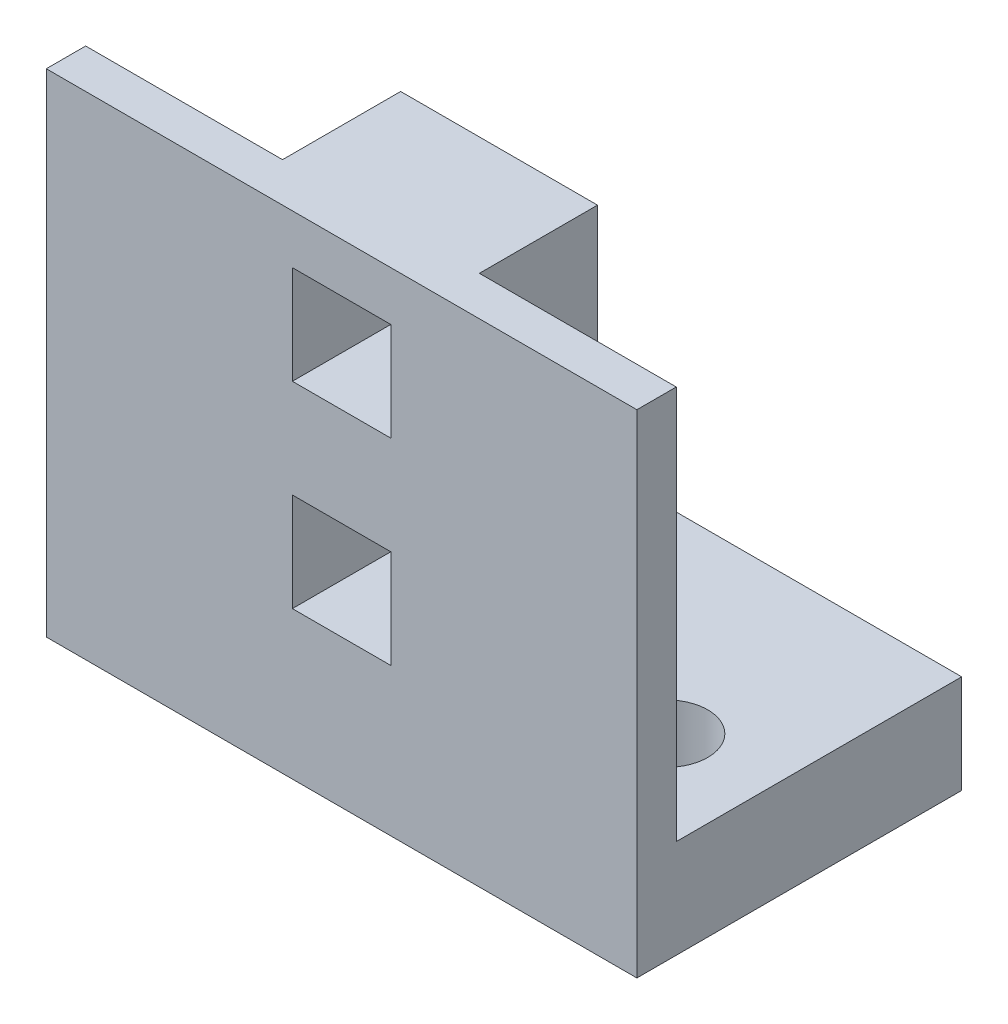
ISO-10303-21;
HEADER;
FILE_DESCRIPTION(('STEP AP214'),'2;1');
FILE_NAME('part.step','',(''),(''),'','','');
FILE_SCHEMA(('AUTOMOTIVE_DESIGN { 1 0 10303 214 1 1 1 1 }'));
ENDSEC;
DATA;
#1=APPLICATION_CONTEXT('core data for automotive mechanical design processes');
#2=APPLICATION_PROTOCOL_DEFINITION('international standard','automotive_design',2000,#1);
#3=PRODUCT_CONTEXT('',#1,'mechanical');
#4=PRODUCT('Part','Part','',(#3));
#5=PRODUCT_RELATED_PRODUCT_CATEGORY('part','',(#4));
#6=PRODUCT_DEFINITION_FORMATION('','',#4);
#7=PRODUCT_DEFINITION_CONTEXT('part definition',#1,'design');
#8=PRODUCT_DEFINITION('design','',#6,#7);
#9=PRODUCT_DEFINITION_SHAPE('','',#8);
#10=(LENGTH_UNIT() NAMED_UNIT(*) SI_UNIT(.MILLI.,.METRE.));
#11=(NAMED_UNIT(*) PLANE_ANGLE_UNIT() SI_UNIT($,.RADIAN.));
#12=(NAMED_UNIT(*) SI_UNIT($,.STERADIAN.) SOLID_ANGLE_UNIT());
#13=UNCERTAINTY_MEASURE_WITH_UNIT(LENGTH_MEASURE(1.E-05),#10,'distance_accuracy_value','');
#14=(GEOMETRIC_REPRESENTATION_CONTEXT(3) GLOBAL_UNCERTAINTY_ASSIGNED_CONTEXT((#13)) GLOBAL_UNIT_ASSIGNED_CONTEXT((#10,
#11,#12)) REPRESENTATION_CONTEXT('',''));
#15=CARTESIAN_POINT('',(0.,0.,0.));
#16=DIRECTION('',(0.,0.,1.));
#17=DIRECTION('',(1.,0.,0.));
#18=AXIS2_PLACEMENT_3D('',#15,#16,#17);
#19=CARTESIAN_POINT('',(0.,5.,0.));
#20=DIRECTION('',(0.,1.,0.));
#21=DIRECTION('',(0.,0.,1.));
#22=AXIS2_PLACEMENT_3D('',#19,#20,#21);
#23=PLANE('',#22);
#24=CARTESIAN_POINT('',(-10.,5.,1.75));
#25=DIRECTION('',(0.,1.,0.));
#26=DIRECTION('',(0.,0.,1.));
#27=AXIS2_PLACEMENT_3D('',#24,#25,#26);
#28=CIRCLE('',#27,2.1);
#29=CARTESIAN_POINT('',(-10.,5.,3.85));
#30=VERTEX_POINT('',#29);
#31=EDGE_CURVE('E337',#30,#30,#28,.T.);
#32=ORIENTED_EDGE('',*,*,#31,.F.);
#33=EDGE_LOOP('',(#32));
#34=FACE_BOUND('',#33,.T.);
#35=CARTESIAN_POINT('',(10.,5.,1.75));
#36=DIRECTION('',(0.,1.,0.));
#37=DIRECTION('',(0.,0.,1.));
#38=AXIS2_PLACEMENT_3D('',#35,#36,#37);
#39=CIRCLE('',#38,2.1);
#40=CARTESIAN_POINT('',(10.,5.,3.85));
#41=VERTEX_POINT('',#40);
#42=EDGE_CURVE('E329',#41,#41,#39,.T.);
#43=ORIENTED_EDGE('',*,*,#42,.F.);
#44=EDGE_LOOP('',(#43));
#45=FACE_BOUND('',#44,.T.);
#46=DIRECTION('',(-1.,0.,0.));
#47=VECTOR('',#46,1.);
#48=CARTESIAN_POINT('',(5.,5.,0.249999999999999));
#49=LINE('',#48,#47);
#50=CARTESIAN_POINT('',(5.,5.,0.249999999999999));
#51=VERTEX_POINT('',#50);
#52=CARTESIAN_POINT('',(-5.00000000000001,5.,0.249999999999999));
#53=VERTEX_POINT('',#52);
#54=EDGE_CURVE('E183',#51,#53,#49,.T.);
#55=ORIENTED_EDGE('',*,*,#54,.F.);
#56=DIRECTION('',(0.,0.,1.));
#57=VECTOR('',#56,1.);
#58=CARTESIAN_POINT('',(5.,5.,2.25));
#59=LINE('',#58,#57);
#60=CARTESIAN_POINT('',(5.,5.,6.25));
#61=VERTEX_POINT('',#60);
#62=EDGE_CURVE('E63',#51,#61,#59,.T.);
#63=ORIENTED_EDGE('',*,*,#62,.T.);
#64=DIRECTION('',(1.,0.,0.));
#65=VECTOR('',#64,1.);
#66=CARTESIAN_POINT('',(-15.,5.,6.25));
#67=LINE('',#66,#65);
#68=CARTESIAN_POINT('',(15.,5.,6.25));
#69=VERTEX_POINT('',#68);
#70=EDGE_CURVE('E305',#61,#69,#67,.T.);
#71=ORIENTED_EDGE('',*,*,#70,.T.);
#72=DIRECTION('',(0.,0.,-1.));
#73=VECTOR('',#72,1.);
#74=CARTESIAN_POINT('',(15.,5.,-8.25));
#75=LINE('',#74,#73);
#76=CARTESIAN_POINT('',(15.,5.,-8.25));
#77=VERTEX_POINT('',#76);
#78=EDGE_CURVE('E345',#69,#77,#75,.T.);
#79=ORIENTED_EDGE('',*,*,#78,.T.);
#80=DIRECTION('',(-1.,0.,0.));
#81=VECTOR('',#80,1.);
#82=CARTESIAN_POINT('',(-15.,5.,-8.25));
#83=LINE('',#82,#81);
#84=CARTESIAN_POINT('',(-15.,5.,-8.25));
#85=VERTEX_POINT('',#84);
#86=EDGE_CURVE('E348',#77,#85,#83,.T.);
#87=ORIENTED_EDGE('',*,*,#86,.T.);
#88=DIRECTION('',(0.,0.,1.));
#89=VECTOR('',#88,1.);
#90=CARTESIAN_POINT('',(-15.,5.,-8.25));
#91=LINE('',#90,#89);
#92=CARTESIAN_POINT('',(-15.,5.,6.25));
#93=VERTEX_POINT('',#92);
#94=EDGE_CURVE('E352',#85,#93,#91,.T.);
#95=ORIENTED_EDGE('',*,*,#94,.T.);
#96=CARTESIAN_POINT('',(-5.00000000000001,5.,6.25));
#97=VERTEX_POINT('',#96);
#98=EDGE_CURVE('E306',#93,#97,#67,.T.);
#99=ORIENTED_EDGE('',*,*,#98,.T.);
#100=DIRECTION('',(0.,0.,1.));
#101=VECTOR('',#100,1.);
#102=CARTESIAN_POINT('',(-5.00000000000001,5.,2.25));
#103=LINE('',#102,#101);
#104=EDGE_CURVE('E55',#53,#97,#103,.T.);
#105=ORIENTED_EDGE('',*,*,#104,.F.);
#106=EDGE_LOOP('',(#55,#63,#71,#79,#87,#95,#99,#105));
#107=FACE_BOUND('',#106,.T.);
#108=ADVANCED_FACE('F39',(#34,#45,#107),#23,.T.);
#109=CARTESIAN_POINT('',(0.,0.,6.25));
#110=DIRECTION('',(0.,0.,-1.));
#111=DIRECTION('',(-1.,0.,0.));
#112=AXIS2_PLACEMENT_3D('',#109,#110,#111);
#113=PLANE('',#112);
#114=ORIENTED_EDGE('',*,*,#70,.F.);
#115=DIRECTION('',(0.,-1.,0.));
#116=VECTOR('',#115,1.);
#117=CARTESIAN_POINT('',(5.,25.,6.25));
#118=LINE('',#117,#116);
#119=CARTESIAN_POINT('',(5.,25.,6.25));
#120=VERTEX_POINT('',#119);
#121=EDGE_CURVE('E225',#120,#61,#118,.T.);
#122=ORIENTED_EDGE('',*,*,#121,.F.);
#123=DIRECTION('',(-1.,0.,0.));
#124=VECTOR('',#123,1.);
#125=CARTESIAN_POINT('',(-15.,25.,6.25));
#126=LINE('',#125,#124);
#127=CARTESIAN_POINT('',(15.,25.,6.25));
#128=VERTEX_POINT('',#127);
#129=EDGE_CURVE('E314',#128,#120,#126,.T.);
#130=ORIENTED_EDGE('',*,*,#129,.F.);
#131=DIRECTION('',(0.,1.,0.));
#132=VECTOR('',#131,1.);
#133=CARTESIAN_POINT('',(15.,5.,6.25));
#134=LINE('',#133,#132);
#135=EDGE_CURVE('E309',#69,#128,#134,.T.);
#136=ORIENTED_EDGE('',*,*,#135,.F.);
#137=EDGE_LOOP('',(#114,#122,#130,#136));
#138=FACE_BOUND('',#137,.T.);
#139=ADVANCED_FACE('F407',(#138),#113,.T.);
#140=CARTESIAN_POINT('',(-5.00000000000001,25.,6.25));
#141=VERTEX_POINT('',#140);
#142=CARTESIAN_POINT('',(-15.,25.,6.25));
#143=VERTEX_POINT('',#142);
#144=EDGE_CURVE('E313',#141,#143,#126,.T.);
#145=ORIENTED_EDGE('',*,*,#144,.F.);
#146=DIRECTION('',(0.,1.,0.));
#147=VECTOR('',#146,1.);
#148=CARTESIAN_POINT('',(-5.,25.,6.25));
#149=LINE('',#148,#147);
#150=EDGE_CURVE('E171',#97,#141,#149,.T.);
#151=ORIENTED_EDGE('',*,*,#150,.F.);
#152=ORIENTED_EDGE('',*,*,#98,.F.);
#153=DIRECTION('',(0.,-1.,0.));
#154=VECTOR('',#153,1.);
#155=CARTESIAN_POINT('',(-15.,5.,6.25));
#156=LINE('',#155,#154);
#157=EDGE_CURVE('E301',#143,#93,#156,.T.);
#158=ORIENTED_EDGE('',*,*,#157,.F.);
#159=EDGE_LOOP('',(#145,#151,#152,#158));
#160=FACE_BOUND('',#159,.T.);
#161=ADVANCED_FACE('F398',(#160),#113,.T.);
#162=CARTESIAN_POINT('',(0.,0.,0.));
#163=DIRECTION('',(0.,1.,0.));
#164=DIRECTION('',(0.,0.,1.));
#165=AXIS2_PLACEMENT_3D('',#162,#163,#164);
#166=PLANE('',#165);
#167=DIRECTION('',(0.,0.,-1.));
#168=VECTOR('',#167,1.);
#169=CARTESIAN_POINT('',(15.,0.,-8.25));
#170=LINE('',#169,#168);
#171=CARTESIAN_POINT('',(15.,0.,8.25));
#172=VERTEX_POINT('',#171);
#173=CARTESIAN_POINT('',(15.,0.,-8.25));
#174=VERTEX_POINT('',#173);
#175=EDGE_CURVE('E341',#172,#174,#170,.T.);
#176=ORIENTED_EDGE('',*,*,#175,.F.);
#177=DIRECTION('',(1.,0.,0.));
#178=VECTOR('',#177,1.);
#179=CARTESIAN_POINT('',(-15.,0.,8.25));
#180=LINE('',#179,#178);
#181=CARTESIAN_POINT('',(-15.,0.,8.25));
#182=VERTEX_POINT('',#181);
#183=EDGE_CURVE('E349',#182,#172,#180,.T.);
#184=ORIENTED_EDGE('',*,*,#183,.F.);
#185=DIRECTION('',(0.,0.,1.));
#186=VECTOR('',#185,1.);
#187=CARTESIAN_POINT('',(-15.,0.,-8.25));
#188=LINE('',#187,#186);
#189=CARTESIAN_POINT('',(-15.,0.,-8.25));
#190=VERTEX_POINT('',#189);
#191=EDGE_CURVE('E363',#190,#182,#188,.T.);
#192=ORIENTED_EDGE('',*,*,#191,.F.);
#193=DIRECTION('',(-1.,0.,0.));
#194=VECTOR('',#193,1.);
#195=CARTESIAN_POINT('',(-15.,0.,-8.25));
#196=LINE('',#195,#194);
#197=EDGE_CURVE('E360',#174,#190,#196,.T.);
#198=ORIENTED_EDGE('',*,*,#197,.F.);
#199=EDGE_LOOP('',(#176,#184,#192,#198));
#200=FACE_BOUND('',#199,.T.);
#201=CARTESIAN_POINT('',(-10.,0.,1.75));
#202=DIRECTION('',(0.,1.,0.));
#203=DIRECTION('',(0.,0.,1.));
#204=AXIS2_PLACEMENT_3D('',#201,#202,#203);
#205=CIRCLE('',#204,2.1);
#206=CARTESIAN_POINT('',(-10.,0.,3.85));
#207=VERTEX_POINT('',#206);
#208=EDGE_CURVE('E333',#207,#207,#205,.T.);
#209=ORIENTED_EDGE('',*,*,#208,.T.);
#210=EDGE_LOOP('',(#209));
#211=FACE_BOUND('',#210,.T.);
#212=CARTESIAN_POINT('',(10.,0.,1.75));
#213=DIRECTION('',(0.,1.,0.));
#214=DIRECTION('',(0.,0.,1.));
#215=AXIS2_PLACEMENT_3D('',#212,#213,#214);
#216=CIRCLE('',#215,2.1);
#217=CARTESIAN_POINT('',(10.,0.,3.85));
#218=VERTEX_POINT('',#217);
#219=EDGE_CURVE('E325',#218,#218,#216,.T.);
#220=ORIENTED_EDGE('',*,*,#219,.T.);
#221=EDGE_LOOP('',(#220));
#222=FACE_BOUND('',#221,.T.);
#223=ADVANCED_FACE('F386',(#200,#211,#222),#166,.F.);
#224=CARTESIAN_POINT('',(15.,5.,-8.25));
#225=DIRECTION('',(-1.,0.,0.));
#226=DIRECTION('',(0.,0.,1.));
#227=AXIS2_PLACEMENT_3D('',#224,#225,#226);
#228=PLANE('',#227);
#229=ORIENTED_EDGE('',*,*,#175,.T.);
#230=DIRECTION('',(0.,-1.,0.));
#231=VECTOR('',#230,1.);
#232=CARTESIAN_POINT('',(15.,5.,-8.25));
#233=LINE('',#232,#231);
#234=EDGE_CURVE('E11',#77,#174,#233,.T.);
#235=ORIENTED_EDGE('',*,*,#234,.F.);
#236=ORIENTED_EDGE('',*,*,#78,.F.);
#237=ORIENTED_EDGE('',*,*,#135,.T.);
#238=DIRECTION('',(0.,0.,1.));
#239=VECTOR('',#238,1.);
#240=CARTESIAN_POINT('',(15.,25.,6.25));
#241=LINE('',#240,#239);
#242=CARTESIAN_POINT('',(15.,25.,8.25));
#243=VERTEX_POINT('',#242);
#244=EDGE_CURVE('E317',#128,#243,#241,.T.);
#245=ORIENTED_EDGE('',*,*,#244,.T.);
#246=DIRECTION('',(0.,-1.,0.));
#247=VECTOR('',#246,1.);
#248=CARTESIAN_POINT('',(15.,5.,8.25));
#249=LINE('',#248,#247);
#250=EDGE_CURVE('E356',#243,#172,#249,.T.);
#251=ORIENTED_EDGE('',*,*,#250,.T.);
#252=EDGE_LOOP('',(#229,#235,#236,#237,#245,#251));
#253=FACE_BOUND('',#252,.T.);
#254=ADVANCED_FACE('F41',(#253),#228,.F.);
#255=CARTESIAN_POINT('',(-15.,5.,-8.25));
#256=DIRECTION('',(0.,0.,1.));
#257=DIRECTION('',(1.,0.,0.));
#258=AXIS2_PLACEMENT_3D('',#255,#256,#257);
#259=PLANE('',#258);
#260=ORIENTED_EDGE('',*,*,#197,.T.);
#261=DIRECTION('',(0.,-1.,0.));
#262=VECTOR('',#261,1.);
#263=CARTESIAN_POINT('',(-15.,5.,-8.25));
#264=LINE('',#263,#262);
#265=EDGE_CURVE('E48',#85,#190,#264,.T.);
#266=ORIENTED_EDGE('',*,*,#265,.F.);
#267=ORIENTED_EDGE('',*,*,#86,.F.);
#268=ORIENTED_EDGE('',*,*,#234,.T.);
#269=EDGE_LOOP('',(#260,#266,#267,#268));
#270=FACE_BOUND('',#269,.T.);
#271=ADVANCED_FACE('F399',(#270),#259,.F.);
#272=CARTESIAN_POINT('',(-15.,5.,-8.25));
#273=DIRECTION('',(1.,0.,0.));
#274=DIRECTION('',(0.,0.,-1.));
#275=AXIS2_PLACEMENT_3D('',#272,#273,#274);
#276=PLANE('',#275);
#277=ORIENTED_EDGE('',*,*,#191,.T.);
#278=DIRECTION('',(0.,-1.,0.));
#279=VECTOR('',#278,1.);
#280=CARTESIAN_POINT('',(-15.,5.,8.25));
#281=LINE('',#280,#279);
#282=CARTESIAN_POINT('',(-15.,25.,8.25));
#283=VERTEX_POINT('',#282);
#284=EDGE_CURVE('E371',#283,#182,#281,.T.);
#285=ORIENTED_EDGE('',*,*,#284,.F.);
#286=DIRECTION('',(0.,0.,1.));
#287=VECTOR('',#286,1.);
#288=CARTESIAN_POINT('',(-15.,25.,6.25));
#289=LINE('',#288,#287);
#290=EDGE_CURVE('E321',#143,#283,#289,.T.);
#291=ORIENTED_EDGE('',*,*,#290,.F.);
#292=ORIENTED_EDGE('',*,*,#157,.T.);
#293=ORIENTED_EDGE('',*,*,#94,.F.);
#294=ORIENTED_EDGE('',*,*,#265,.T.);
#295=EDGE_LOOP('',(#277,#285,#291,#292,#293,#294));
#296=FACE_BOUND('',#295,.T.);
#297=ADVANCED_FACE('F380',(#296),#276,.F.);
#298=CARTESIAN_POINT('',(-15.,5.,8.25));
#299=DIRECTION('',(0.,0.,-1.));
#300=DIRECTION('',(-1.,0.,0.));
#301=AXIS2_PLACEMENT_3D('',#298,#299,#300);
#302=PLANE('',#301);
#303=DIRECTION('',(1.,0.,0.));
#304=VECTOR('',#303,1.);
#305=CARTESIAN_POINT('',(2.5,12.5,8.25));
#306=LINE('',#305,#304);
#307=CARTESIAN_POINT('',(-2.5,12.5,8.25));
#308=VERTEX_POINT('',#307);
#309=CARTESIAN_POINT('',(2.5,12.5,8.25));
#310=VERTEX_POINT('',#309);
#311=EDGE_CURVE('E250',#308,#310,#306,.T.);
#312=ORIENTED_EDGE('',*,*,#311,.T.);
#313=DIRECTION('',(0.,-1.,0.));
#314=VECTOR('',#313,1.);
#315=CARTESIAN_POINT('',(2.5,7.5,8.25));
#316=LINE('',#315,#314);
#317=CARTESIAN_POINT('',(2.5,7.5,8.25));
#318=VERTEX_POINT('',#317);
#319=EDGE_CURVE('E237',#310,#318,#316,.T.);
#320=ORIENTED_EDGE('',*,*,#319,.T.);
#321=DIRECTION('',(-1.,0.,0.));
#322=VECTOR('',#321,1.);
#323=CARTESIAN_POINT('',(2.5,7.5,8.25));
#324=LINE('',#323,#322);
#325=CARTESIAN_POINT('',(-2.5,7.5,8.25));
#326=VERTEX_POINT('',#325);
#327=EDGE_CURVE('E241',#318,#326,#324,.T.);
#328=ORIENTED_EDGE('',*,*,#327,.T.);
#329=DIRECTION('',(0.,1.,0.));
#330=VECTOR('',#329,1.);
#331=CARTESIAN_POINT('',(-2.5,7.5,8.25));
#332=LINE('',#331,#330);
#333=EDGE_CURVE('E246',#326,#308,#332,.T.);
#334=ORIENTED_EDGE('',*,*,#333,.T.);
#335=EDGE_LOOP('',(#312,#320,#328,#334));
#336=FACE_BOUND('',#335,.T.);
#337=DIRECTION('',(1.,0.,0.));
#338=VECTOR('',#337,1.);
#339=CARTESIAN_POINT('',(2.5,22.5,8.25));
#340=LINE('',#339,#338);
#341=CARTESIAN_POINT('',(-2.5,22.5,8.25));
#342=VERTEX_POINT('',#341);
#343=CARTESIAN_POINT('',(2.5,22.5,8.25));
#344=VERTEX_POINT('',#343);
#345=EDGE_CURVE('E282',#342,#344,#340,.T.);
#346=ORIENTED_EDGE('',*,*,#345,.T.);
#347=DIRECTION('',(0.,-1.,0.));
#348=VECTOR('',#347,1.);
#349=CARTESIAN_POINT('',(2.5,17.5,8.25));
#350=LINE('',#349,#348);
#351=CARTESIAN_POINT('',(2.5,17.5,8.25));
#352=VERTEX_POINT('',#351);
#353=EDGE_CURVE('E236',#344,#352,#350,.T.);
#354=ORIENTED_EDGE('',*,*,#353,.T.);
#355=DIRECTION('',(-1.,0.,0.));
#356=VECTOR('',#355,1.);
#357=CARTESIAN_POINT('',(2.5,17.5,8.25));
#358=LINE('',#357,#356);
#359=CARTESIAN_POINT('',(-2.5,17.5,8.25));
#360=VERTEX_POINT('',#359);
#361=EDGE_CURVE('E274',#352,#360,#358,.T.);
#362=ORIENTED_EDGE('',*,*,#361,.T.);
#363=DIRECTION('',(0.,1.,0.));
#364=VECTOR('',#363,1.);
#365=CARTESIAN_POINT('',(-2.5,17.5,8.25));
#366=LINE('',#365,#364);
#367=EDGE_CURVE('E278',#360,#342,#366,.T.);
#368=ORIENTED_EDGE('',*,*,#367,.T.);
#369=EDGE_LOOP('',(#346,#354,#362,#368));
#370=FACE_BOUND('',#369,.T.);
#371=ORIENTED_EDGE('',*,*,#183,.T.);
#372=ORIENTED_EDGE('',*,*,#250,.F.);
#373=DIRECTION('',(-1.,0.,0.));
#374=VECTOR('',#373,1.);
#375=CARTESIAN_POINT('',(-15.,25.,8.25));
#376=LINE('',#375,#374);
#377=EDGE_CURVE('E259',#243,#283,#376,.T.);
#378=ORIENTED_EDGE('',*,*,#377,.T.);
#379=ORIENTED_EDGE('',*,*,#284,.T.);
#380=EDGE_LOOP('',(#371,#372,#378,#379));
#381=FACE_BOUND('',#380,.T.);
#382=ADVANCED_FACE('F389',(#336,#370,#381),#302,.F.);
#383=CARTESIAN_POINT('',(-10.,5.,1.75));
#384=DIRECTION('',(0.,-1.,0.));
#385=DIRECTION('',(0.,0.,-1.));
#386=AXIS2_PLACEMENT_3D('',#383,#384,#385);
#387=CYLINDRICAL_SURFACE('',#386,2.1);
#388=ORIENTED_EDGE('',*,*,#31,.T.);
#389=EDGE_LOOP('',(#388));
#390=FACE_BOUND('',#389,.T.);
#391=ORIENTED_EDGE('',*,*,#208,.F.);
#392=EDGE_LOOP('',(#391));
#393=FACE_BOUND('',#392,.T.);
#394=ADVANCED_FACE('F419',(#390,#393),#387,.F.);
#395=CARTESIAN_POINT('',(10.,5.,1.75));
#396=DIRECTION('',(0.,-1.,0.));
#397=DIRECTION('',(0.,0.,-1.));
#398=AXIS2_PLACEMENT_3D('',#395,#396,#397);
#399=CYLINDRICAL_SURFACE('',#398,2.1);
#400=ORIENTED_EDGE('',*,*,#42,.T.);
#401=EDGE_LOOP('',(#400));
#402=FACE_BOUND('',#401,.T.);
#403=ORIENTED_EDGE('',*,*,#219,.F.);
#404=EDGE_LOOP('',(#403));
#405=FACE_BOUND('',#404,.T.);
#406=ADVANCED_FACE('F428',(#402,#405),#399,.F.);
#407=CARTESIAN_POINT('',(-15.,25.,6.25));
#408=DIRECTION('',(0.,1.,0.));
#409=DIRECTION('',(0.,0.,1.));
#410=AXIS2_PLACEMENT_3D('',#407,#408,#409);
#411=PLANE('',#410);
#412=ORIENTED_EDGE('',*,*,#377,.F.);
#413=ORIENTED_EDGE('',*,*,#244,.F.);
#414=ORIENTED_EDGE('',*,*,#129,.T.);
#415=DIRECTION('',(0.,0.,1.));
#416=VECTOR('',#415,1.);
#417=CARTESIAN_POINT('',(5.,25.,2.25));
#418=LINE('',#417,#416);
#419=CARTESIAN_POINT('',(5.,25.,0.249999999999999));
#420=VERTEX_POINT('',#419);
#421=EDGE_CURVE('E176',#420,#120,#418,.T.);
#422=ORIENTED_EDGE('',*,*,#421,.F.);
#423=DIRECTION('',(1.,0.,0.));
#424=VECTOR('',#423,1.);
#425=CARTESIAN_POINT('',(5.,25.,0.249999999999999));
#426=LINE('',#425,#424);
#427=CARTESIAN_POINT('',(-5.00000000000001,25.,0.249999999999999));
#428=VERTEX_POINT('',#427);
#429=EDGE_CURVE('E182',#428,#420,#426,.T.);
#430=ORIENTED_EDGE('',*,*,#429,.F.);
#431=DIRECTION('',(0.,0.,1.));
#432=VECTOR('',#431,1.);
#433=CARTESIAN_POINT('',(-5.,25.,2.25));
#434=LINE('',#433,#432);
#435=EDGE_CURVE('E166',#428,#141,#434,.T.);
#436=ORIENTED_EDGE('',*,*,#435,.T.);
#437=ORIENTED_EDGE('',*,*,#144,.T.);
#438=ORIENTED_EDGE('',*,*,#290,.T.);
#439=EDGE_LOOP('',(#412,#413,#414,#422,#430,#436,#437,#438));
#440=FACE_BOUND('',#439,.T.);
#441=ADVANCED_FACE('F187',(#440),#411,.T.);
#442=CARTESIAN_POINT('',(2.5,17.5,8.25));
#443=DIRECTION('',(1.,0.,0.));
#444=DIRECTION('',(0.,0.,-1.));
#445=AXIS2_PLACEMENT_3D('',#442,#443,#444);
#446=PLANE('',#445);
#447=DIRECTION('',(0.,0.,-1.));
#448=VECTOR('',#447,1.);
#449=CARTESIAN_POINT('',(2.5,22.5,8.25));
#450=LINE('',#449,#448);
#451=CARTESIAN_POINT('',(2.5,22.5,2.25));
#452=VERTEX_POINT('',#451);
#453=EDGE_CURVE('E242',#344,#452,#450,.T.);
#454=ORIENTED_EDGE('',*,*,#453,.T.);
#455=DIRECTION('',(0.,-1.,0.));
#456=VECTOR('',#455,1.);
#457=CARTESIAN_POINT('',(2.5,22.5,2.25));
#458=LINE('',#457,#456);
#459=CARTESIAN_POINT('',(2.5,17.5,2.25));
#460=VERTEX_POINT('',#459);
#461=EDGE_CURVE('E209',#452,#460,#458,.T.);
#462=ORIENTED_EDGE('',*,*,#461,.T.);
#463=DIRECTION('',(0.,0.,-1.));
#464=VECTOR('',#463,1.);
#465=CARTESIAN_POINT('',(2.5,17.5,8.25));
#466=LINE('',#465,#464);
#467=EDGE_CURVE('E286',#352,#460,#466,.T.);
#468=ORIENTED_EDGE('',*,*,#467,.F.);
#469=ORIENTED_EDGE('',*,*,#353,.F.);
#470=EDGE_LOOP('',(#454,#462,#468,#469));
#471=FACE_BOUND('',#470,.T.);
#472=ADVANCED_FACE('F437',(#471),#446,.F.);
#473=CARTESIAN_POINT('',(2.5,22.5,8.25));
#474=DIRECTION('',(0.,1.,0.));
#475=DIRECTION('',(0.,0.,1.));
#476=AXIS2_PLACEMENT_3D('',#473,#474,#475);
#477=PLANE('',#476);
#478=DIRECTION('',(0.,0.,-1.));
#479=VECTOR('',#478,1.);
#480=CARTESIAN_POINT('',(-2.5,22.5,8.25));
#481=LINE('',#480,#479);
#482=CARTESIAN_POINT('',(-2.5,22.5,2.25));
#483=VERTEX_POINT('',#482);
#484=EDGE_CURVE('E290',#342,#483,#481,.T.);
#485=ORIENTED_EDGE('',*,*,#484,.T.);
#486=DIRECTION('',(1.,0.,0.));
#487=VECTOR('',#486,1.);
#488=CARTESIAN_POINT('',(2.5,22.5,2.25));
#489=LINE('',#488,#487);
#490=EDGE_CURVE('E221',#483,#452,#489,.T.);
#491=ORIENTED_EDGE('',*,*,#490,.T.);
#492=ORIENTED_EDGE('',*,*,#453,.F.);
#493=ORIENTED_EDGE('',*,*,#345,.F.);
#494=EDGE_LOOP('',(#485,#491,#492,#493));
#495=FACE_BOUND('',#494,.T.);
#496=ADVANCED_FACE('F435',(#495),#477,.F.);
#497=CARTESIAN_POINT('',(-2.5,17.5,8.25));
#498=DIRECTION('',(-1.,0.,0.));
#499=DIRECTION('',(0.,0.,1.));
#500=AXIS2_PLACEMENT_3D('',#497,#498,#499);
#501=PLANE('',#500);
#502=DIRECTION('',(0.,0.,-1.));
#503=VECTOR('',#502,1.);
#504=CARTESIAN_POINT('',(-2.5,17.5,8.25));
#505=LINE('',#504,#503);
#506=CARTESIAN_POINT('',(-2.5,17.5,2.25));
#507=VERTEX_POINT('',#506);
#508=EDGE_CURVE('E294',#360,#507,#505,.T.);
#509=ORIENTED_EDGE('',*,*,#508,.T.);
#510=DIRECTION('',(0.,1.,0.));
#511=VECTOR('',#510,1.);
#512=CARTESIAN_POINT('',(-2.5,22.5,2.25));
#513=LINE('',#512,#511);
#514=EDGE_CURVE('E217',#507,#483,#513,.T.);
#515=ORIENTED_EDGE('',*,*,#514,.T.);
#516=ORIENTED_EDGE('',*,*,#484,.F.);
#517=ORIENTED_EDGE('',*,*,#367,.F.);
#518=EDGE_LOOP('',(#509,#515,#516,#517));
#519=FACE_BOUND('',#518,.T.);
#520=ADVANCED_FACE('F443',(#519),#501,.F.);
#521=CARTESIAN_POINT('',(2.5,17.5,8.25));
#522=DIRECTION('',(0.,-1.,0.));
#523=DIRECTION('',(0.,0.,-1.));
#524=AXIS2_PLACEMENT_3D('',#521,#522,#523);
#525=PLANE('',#524);
#526=ORIENTED_EDGE('',*,*,#467,.T.);
#527=DIRECTION('',(-1.,0.,0.));
#528=VECTOR('',#527,1.);
#529=CARTESIAN_POINT('',(2.5,17.5,2.25));
#530=LINE('',#529,#528);
#531=EDGE_CURVE('E213',#460,#507,#530,.T.);
#532=ORIENTED_EDGE('',*,*,#531,.T.);
#533=ORIENTED_EDGE('',*,*,#508,.F.);
#534=ORIENTED_EDGE('',*,*,#361,.F.);
#535=EDGE_LOOP('',(#526,#532,#533,#534));
#536=FACE_BOUND('',#535,.T.);
#537=ADVANCED_FACE('F441',(#536),#525,.F.);
#538=CARTESIAN_POINT('',(2.5,7.5,8.25));
#539=DIRECTION('',(1.,0.,0.));
#540=DIRECTION('',(0.,0.,-1.));
#541=AXIS2_PLACEMENT_3D('',#538,#539,#540);
#542=PLANE('',#541);
#543=DIRECTION('',(0.,0.,-1.));
#544=VECTOR('',#543,1.);
#545=CARTESIAN_POINT('',(2.5,12.5,8.25));
#546=LINE('',#545,#544);
#547=CARTESIAN_POINT('',(2.5,12.5,2.25));
#548=VERTEX_POINT('',#547);
#549=EDGE_CURVE('E255',#310,#548,#546,.T.);
#550=ORIENTED_EDGE('',*,*,#549,.T.);
#551=DIRECTION('',(0.,-1.,0.));
#552=VECTOR('',#551,1.);
#553=CARTESIAN_POINT('',(2.5,12.5,2.25));
#554=LINE('',#553,#552);
#555=CARTESIAN_POINT('',(2.5,7.5,2.25));
#556=VERTEX_POINT('',#555);
#557=EDGE_CURVE('E190',#548,#556,#554,.T.);
#558=ORIENTED_EDGE('',*,*,#557,.T.);
#559=DIRECTION('',(0.,0.,-1.));
#560=VECTOR('',#559,1.);
#561=CARTESIAN_POINT('',(2.5,7.5,8.25));
#562=LINE('',#561,#560);
#563=EDGE_CURVE('E254',#318,#556,#562,.T.);
#564=ORIENTED_EDGE('',*,*,#563,.F.);
#565=ORIENTED_EDGE('',*,*,#319,.F.);
#566=EDGE_LOOP('',(#550,#558,#564,#565));
#567=FACE_BOUND('',#566,.T.);
#568=ADVANCED_FACE('F465',(#567),#542,.F.);
#569=CARTESIAN_POINT('',(2.5,12.5,8.25));
#570=DIRECTION('',(0.,1.,0.));
#571=DIRECTION('',(0.,0.,1.));
#572=AXIS2_PLACEMENT_3D('',#569,#570,#571);
#573=PLANE('',#572);
#574=DIRECTION('',(0.,0.,-1.));
#575=VECTOR('',#574,1.);
#576=CARTESIAN_POINT('',(-2.5,12.5,8.25));
#577=LINE('',#576,#575);
#578=CARTESIAN_POINT('',(-2.5,12.5,2.25));
#579=VERTEX_POINT('',#578);
#580=EDGE_CURVE('E260',#308,#579,#577,.T.);
#581=ORIENTED_EDGE('',*,*,#580,.T.);
#582=DIRECTION('',(1.,0.,0.));
#583=VECTOR('',#582,1.);
#584=CARTESIAN_POINT('',(2.5,12.5,2.25));
#585=LINE('',#584,#583);
#586=EDGE_CURVE('E205',#579,#548,#585,.T.);
#587=ORIENTED_EDGE('',*,*,#586,.T.);
#588=ORIENTED_EDGE('',*,*,#549,.F.);
#589=ORIENTED_EDGE('',*,*,#311,.F.);
#590=EDGE_LOOP('',(#581,#587,#588,#589));
#591=FACE_BOUND('',#590,.T.);
#592=ADVANCED_FACE('F461',(#591),#573,.F.);
#593=CARTESIAN_POINT('',(-2.5,7.5,8.25));
#594=DIRECTION('',(-1.,0.,0.));
#595=DIRECTION('',(0.,0.,1.));
#596=AXIS2_PLACEMENT_3D('',#593,#594,#595);
#597=PLANE('',#596);
#598=DIRECTION('',(0.,0.,-1.));
#599=VECTOR('',#598,1.);
#600=CARTESIAN_POINT('',(-2.5,7.5,8.25));
#601=LINE('',#600,#599);
#602=CARTESIAN_POINT('',(-2.5,7.5,2.25));
#603=VERTEX_POINT('',#602);
#604=EDGE_CURVE('E264',#326,#603,#601,.T.);
#605=ORIENTED_EDGE('',*,*,#604,.T.);
#606=DIRECTION('',(0.,1.,0.));
#607=VECTOR('',#606,1.);
#608=CARTESIAN_POINT('',(-2.5,12.5,2.25));
#609=LINE('',#608,#607);
#610=EDGE_CURVE('E201',#603,#579,#609,.T.);
#611=ORIENTED_EDGE('',*,*,#610,.T.);
#612=ORIENTED_EDGE('',*,*,#580,.F.);
#613=ORIENTED_EDGE('',*,*,#333,.F.);
#614=EDGE_LOOP('',(#605,#611,#612,#613));
#615=FACE_BOUND('',#614,.T.);
#616=ADVANCED_FACE('F464',(#615),#597,.F.);
#617=CARTESIAN_POINT('',(2.5,7.5,8.25));
#618=DIRECTION('',(0.,-1.,0.));
#619=DIRECTION('',(0.,0.,-1.));
#620=AXIS2_PLACEMENT_3D('',#617,#618,#619);
#621=PLANE('',#620);
#622=ORIENTED_EDGE('',*,*,#563,.T.);
#623=DIRECTION('',(-1.,0.,0.));
#624=VECTOR('',#623,1.);
#625=CARTESIAN_POINT('',(2.5,7.5,2.25));
#626=LINE('',#625,#624);
#627=EDGE_CURVE('E194',#556,#603,#626,.T.);
#628=ORIENTED_EDGE('',*,*,#627,.T.);
#629=ORIENTED_EDGE('',*,*,#604,.F.);
#630=ORIENTED_EDGE('',*,*,#327,.F.);
#631=EDGE_LOOP('',(#622,#628,#629,#630));
#632=FACE_BOUND('',#631,.T.);
#633=ADVANCED_FACE('F460',(#632),#621,.F.);
#634=CARTESIAN_POINT('',(5.,25.,2.25));
#635=DIRECTION('',(-1.,0.,0.));
#636=DIRECTION('',(0.,-1.,0.));
#637=AXIS2_PLACEMENT_3D('',#634,#635,#636);
#638=PLANE('',#637);
#639=ORIENTED_EDGE('',*,*,#121,.T.);
#640=ORIENTED_EDGE('',*,*,#62,.F.);
#641=DIRECTION('',(0.,-1.,0.));
#642=VECTOR('',#641,1.);
#643=CARTESIAN_POINT('',(5.,25.,0.249999999999999));
#644=LINE('',#643,#642);
#645=EDGE_CURVE('E682',#420,#51,#644,.T.);
#646=ORIENTED_EDGE('',*,*,#645,.F.);
#647=ORIENTED_EDGE('',*,*,#421,.T.);
#648=EDGE_LOOP('',(#639,#640,#646,#647));
#649=FACE_BOUND('',#648,.T.);
#650=ADVANCED_FACE('F457',(#649),#638,.F.);
#651=CARTESIAN_POINT('',(-5.,25.,2.25));
#652=DIRECTION('',(1.,0.,0.));
#653=DIRECTION('',(0.,1.,0.));
#654=AXIS2_PLACEMENT_3D('',#651,#652,#653);
#655=PLANE('',#654);
#656=ORIENTED_EDGE('',*,*,#150,.T.);
#657=ORIENTED_EDGE('',*,*,#435,.F.);
#658=DIRECTION('',(0.,1.,0.));
#659=VECTOR('',#658,1.);
#660=CARTESIAN_POINT('',(-5.00000000000001,25.,0.249999999999999));
#661=LINE('',#660,#659);
#662=EDGE_CURVE('E169',#53,#428,#661,.T.);
#663=ORIENTED_EDGE('',*,*,#662,.F.);
#664=ORIENTED_EDGE('',*,*,#104,.T.);
#665=EDGE_LOOP('',(#656,#657,#663,#664));
#666=FACE_BOUND('',#665,.T.);
#667=ADVANCED_FACE('F168',(#666),#655,.F.);
#668=CARTESIAN_POINT('',(0.,0.,0.249999999999999));
#669=DIRECTION('',(0.,0.,-1.));
#670=DIRECTION('',(-1.,0.,0.));
#671=AXIS2_PLACEMENT_3D('',#668,#669,#670);
#672=PLANE('',#671);
#673=ORIENTED_EDGE('',*,*,#645,.T.);
#674=ORIENTED_EDGE('',*,*,#54,.T.);
#675=ORIENTED_EDGE('',*,*,#662,.T.);
#676=ORIENTED_EDGE('',*,*,#429,.T.);
#677=EDGE_LOOP('',(#673,#674,#675,#676));
#678=FACE_BOUND('',#677,.T.);
#679=ADVANCED_FACE('F181',(#678),#672,.T.);
#680=CARTESIAN_POINT('',(0.,0.,2.25));
#681=DIRECTION('',(0.,0.,-1.));
#682=DIRECTION('',(-1.,0.,0.));
#683=AXIS2_PLACEMENT_3D('',#680,#681,#682);
#684=PLANE('',#683);
#685=ORIENTED_EDGE('',*,*,#627,.F.);
#686=ORIENTED_EDGE('',*,*,#557,.F.);
#687=ORIENTED_EDGE('',*,*,#586,.F.);
#688=ORIENTED_EDGE('',*,*,#610,.F.);
#689=EDGE_LOOP('',(#685,#686,#687,#688));
#690=FACE_BOUND('',#689,.T.);
#691=ADVANCED_FACE('F447',(#690),#684,.F.);
#692=ORIENTED_EDGE('',*,*,#531,.F.);
#693=ORIENTED_EDGE('',*,*,#461,.F.);
#694=ORIENTED_EDGE('',*,*,#490,.F.);
#695=ORIENTED_EDGE('',*,*,#514,.F.);
#696=EDGE_LOOP('',(#692,#693,#694,#695));
#697=FACE_BOUND('',#696,.T.);
#698=ADVANCED_FACE('F445',(#697),#684,.F.);
#699=CLOSED_SHELL('',(#108,#139,#161,#223,#254,#271,#297,#382,#394,#406,#441,#472,#496,#520,
#537,#568,#592,#616,#633,#650,#667,#679,#691,#698));
#700=MANIFOLD_SOLID_BREP('B2',#699);
#701=ADVANCED_BREP_SHAPE_REPRESENTATION('',(#18,#700),#14);
#702=SHAPE_DEFINITION_REPRESENTATION(#9,#701);
ENDSEC;
END-ISO-10303-21;
